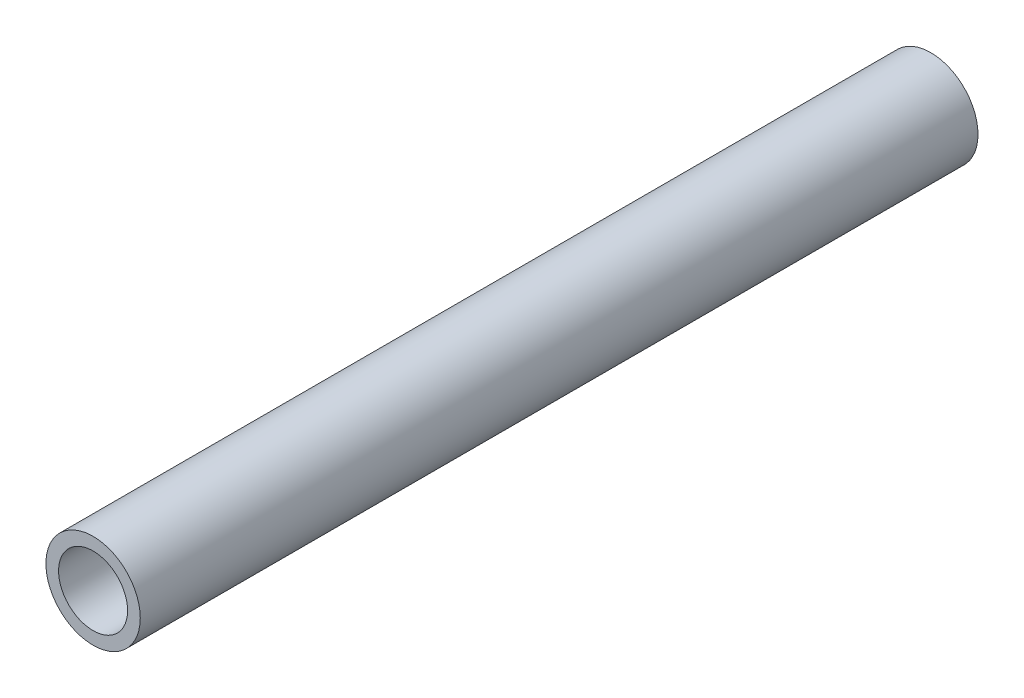
ISO-10303-21;
HEADER;
FILE_DESCRIPTION(('STEP AP214'),'2;1');
FILE_NAME('part.step','',(''),(''),'','','');
FILE_SCHEMA(('AUTOMOTIVE_DESIGN { 1 0 10303 214 1 1 1 1 }'));
ENDSEC;
DATA;
#1=APPLICATION_CONTEXT('core data for automotive mechanical design processes');
#2=APPLICATION_PROTOCOL_DEFINITION('international standard','automotive_design',2000,#1);
#3=PRODUCT_CONTEXT('',#1,'mechanical');
#4=PRODUCT('Part','Part','',(#3));
#5=PRODUCT_RELATED_PRODUCT_CATEGORY('part','',(#4));
#6=PRODUCT_DEFINITION_FORMATION('','',#4);
#7=PRODUCT_DEFINITION_CONTEXT('part definition',#1,'design');
#8=PRODUCT_DEFINITION('design','',#6,#7);
#9=PRODUCT_DEFINITION_SHAPE('','',#8);
#10=(LENGTH_UNIT() NAMED_UNIT(*) SI_UNIT(.MILLI.,.METRE.));
#11=(NAMED_UNIT(*) PLANE_ANGLE_UNIT() SI_UNIT($,.RADIAN.));
#12=(NAMED_UNIT(*) SI_UNIT($,.STERADIAN.) SOLID_ANGLE_UNIT());
#13=UNCERTAINTY_MEASURE_WITH_UNIT(LENGTH_MEASURE(1.E-05),#10,'distance_accuracy_value','');
#14=(GEOMETRIC_REPRESENTATION_CONTEXT(3) GLOBAL_UNCERTAINTY_ASSIGNED_CONTEXT((#13)) GLOBAL_UNIT_ASSIGNED_CONTEXT((#10,
#11,#12)) REPRESENTATION_CONTEXT('',''));
#15=CARTESIAN_POINT('',(0.,0.,0.));
#16=DIRECTION('',(0.,0.,1.));
#17=DIRECTION('',(1.,0.,0.));
#18=AXIS2_PLACEMENT_3D('',#15,#16,#17);
#19=CARTESIAN_POINT('',(0.,0.,95.));
#20=DIRECTION('',(0.,0.,1.));
#21=DIRECTION('',(1.,0.,0.));
#22=AXIS2_PLACEMENT_3D('',#19,#20,#21);
#23=PLANE('',#22);
#24=CARTESIAN_POINT('',(0.,0.,95.));
#25=DIRECTION('',(0.,0.,1.));
#26=DIRECTION('',(1.,0.,0.));
#27=AXIS2_PLACEMENT_3D('',#24,#25,#26);
#28=CIRCLE('',#27,10.7);
#29=CARTESIAN_POINT('',(10.7,0.,95.));
#30=VERTEX_POINT('',#29);
#31=EDGE_CURVE('E10',#30,#30,#28,.T.);
#32=ORIENTED_EDGE('',*,*,#31,.T.);
#33=EDGE_LOOP('',(#32));
#34=FACE_BOUND('',#33,.T.);
#35=CARTESIAN_POINT('',(0.,0.,95.));
#36=DIRECTION('',(0.,0.,1.));
#37=DIRECTION('',(1.,0.,0.));
#38=AXIS2_PLACEMENT_3D('',#35,#36,#37);
#39=CIRCLE('',#38,7.825);
#40=CARTESIAN_POINT('',(7.825,0.,95.));
#41=VERTEX_POINT('',#40);
#42=EDGE_CURVE('E41',#41,#41,#39,.T.);
#43=ORIENTED_EDGE('',*,*,#42,.F.);
#44=EDGE_LOOP('',(#43));
#45=FACE_BOUND('',#44,.T.);
#46=ADVANCED_FACE('F30',(#34,#45),#23,.T.);
#47=CARTESIAN_POINT('',(0.,0.,-95.));
#48=DIRECTION('',(0.,0.,1.));
#49=DIRECTION('',(1.,0.,0.));
#50=AXIS2_PLACEMENT_3D('',#47,#48,#49);
#51=PLANE('',#50);
#52=CARTESIAN_POINT('',(0.,0.,-95.));
#53=DIRECTION('',(0.,0.,1.));
#54=DIRECTION('',(1.,0.,0.));
#55=AXIS2_PLACEMENT_3D('',#52,#53,#54);
#56=CIRCLE('',#55,10.7);
#57=CARTESIAN_POINT('',(10.7,0.,-95.));
#58=VERTEX_POINT('',#57);
#59=EDGE_CURVE('E34',#58,#58,#56,.T.);
#60=ORIENTED_EDGE('',*,*,#59,.F.);
#61=EDGE_LOOP('',(#60));
#62=FACE_BOUND('',#61,.T.);
#63=CARTESIAN_POINT('',(0.,0.,-95.));
#64=DIRECTION('',(0.,0.,1.));
#65=DIRECTION('',(1.,0.,0.));
#66=AXIS2_PLACEMENT_3D('',#63,#64,#65);
#67=CIRCLE('',#66,7.825);
#68=CARTESIAN_POINT('',(7.825,0.,-95.));
#69=VERTEX_POINT('',#68);
#70=EDGE_CURVE('E43',#69,#69,#67,.T.);
#71=ORIENTED_EDGE('',*,*,#70,.T.);
#72=EDGE_LOOP('',(#71));
#73=FACE_BOUND('',#72,.T.);
#74=ADVANCED_FACE('F53',(#62,#73),#51,.F.);
#75=CARTESIAN_POINT('',(0.,0.,95.));
#76=DIRECTION('',(0.,0.,-1.));
#77=DIRECTION('',(-1.,0.,0.));
#78=AXIS2_PLACEMENT_3D('',#75,#76,#77);
#79=CYLINDRICAL_SURFACE('',#78,10.7);
#80=ORIENTED_EDGE('',*,*,#31,.F.);
#81=EDGE_LOOP('',(#80));
#82=FACE_BOUND('',#81,.T.);
#83=ORIENTED_EDGE('',*,*,#59,.T.);
#84=EDGE_LOOP('',(#83));
#85=FACE_BOUND('',#84,.T.);
#86=ADVANCED_FACE('F32',(#82,#85),#79,.T.);
#87=CARTESIAN_POINT('',(0.,0.,95.));
#88=DIRECTION('',(0.,0.,-1.));
#89=DIRECTION('',(-1.,0.,0.));
#90=AXIS2_PLACEMENT_3D('',#87,#88,#89);
#91=CYLINDRICAL_SURFACE('',#90,7.825);
#92=ORIENTED_EDGE('',*,*,#42,.T.);
#93=EDGE_LOOP('',(#92));
#94=FACE_BOUND('',#93,.T.);
#95=ORIENTED_EDGE('',*,*,#70,.F.);
#96=EDGE_LOOP('',(#95));
#97=FACE_BOUND('',#96,.T.);
#98=ADVANCED_FACE('F49',(#94,#97),#91,.F.);
#99=CLOSED_SHELL('',(#46,#74,#86,#98));
#100=MANIFOLD_SOLID_BREP('B2',#99);
#101=ADVANCED_BREP_SHAPE_REPRESENTATION('',(#18,#100),#14);
#102=SHAPE_DEFINITION_REPRESENTATION(#9,#101);
ENDSEC;
END-ISO-10303-21;
